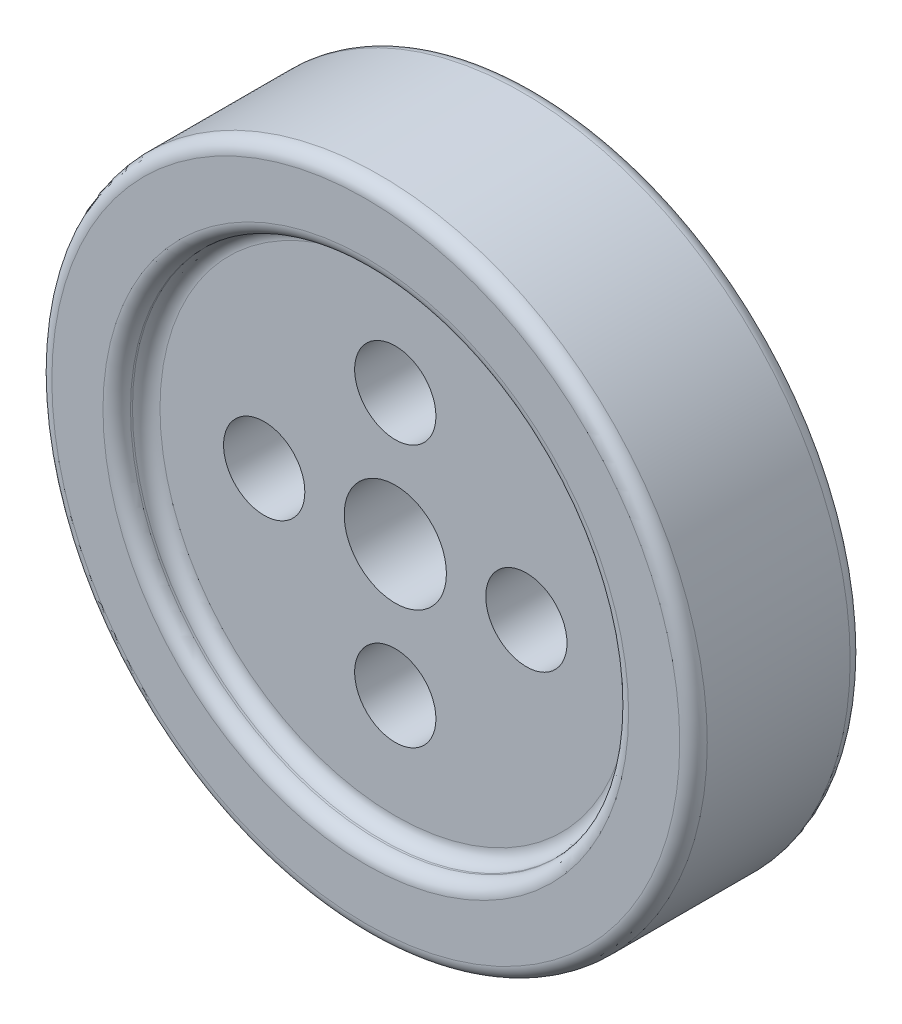
ISO-10303-21;
HEADER;
FILE_DESCRIPTION(('STEP AP214'),'2;1');
FILE_NAME('part.step','',(''),(''),'','','');
FILE_SCHEMA(('AUTOMOTIVE_DESIGN { 1 0 10303 214 1 1 1 1 }'));
ENDSEC;
DATA;
#1=APPLICATION_CONTEXT('core data for automotive mechanical design processes');
#2=APPLICATION_PROTOCOL_DEFINITION('international standard','automotive_design',2000,#1);
#3=PRODUCT_CONTEXT('',#1,'mechanical');
#4=PRODUCT('Part','Part','',(#3));
#5=PRODUCT_RELATED_PRODUCT_CATEGORY('part','',(#4));
#6=PRODUCT_DEFINITION_FORMATION('','',#4);
#7=PRODUCT_DEFINITION_CONTEXT('part definition',#1,'design');
#8=PRODUCT_DEFINITION('design','',#6,#7);
#9=PRODUCT_DEFINITION_SHAPE('','',#8);
#10=(LENGTH_UNIT() NAMED_UNIT(*) SI_UNIT(.MILLI.,.METRE.));
#11=(NAMED_UNIT(*) PLANE_ANGLE_UNIT() SI_UNIT($,.RADIAN.));
#12=(NAMED_UNIT(*) SI_UNIT($,.STERADIAN.) SOLID_ANGLE_UNIT());
#13=UNCERTAINTY_MEASURE_WITH_UNIT(LENGTH_MEASURE(1.E-05),#10,'distance_accuracy_value','');
#14=(GEOMETRIC_REPRESENTATION_CONTEXT(3) GLOBAL_UNCERTAINTY_ASSIGNED_CONTEXT((#13)) GLOBAL_UNIT_ASSIGNED_CONTEXT((#10,
#11,#12)) REPRESENTATION_CONTEXT('',''));
#15=CARTESIAN_POINT('',(0.,0.,0.));
#16=DIRECTION('',(0.,0.,1.));
#17=DIRECTION('',(1.,0.,0.));
#18=AXIS2_PLACEMENT_3D('',#15,#16,#17);
#19=CARTESIAN_POINT('',(0.,0.,130.));
#20=DIRECTION('',(0.,0.,-1.));
#21=DIRECTION('',(-1.,0.,0.));
#22=AXIS2_PLACEMENT_3D('',#19,#20,#21);
#23=CYLINDRICAL_SURFACE('',#22,250.);
#24=CARTESIAN_POINT('',(0.,0.,10.5));
#25=DIRECTION('',(0.,0.,1.));
#26=DIRECTION('',(1.,0.,0.));
#27=AXIS2_PLACEMENT_3D('',#24,#25,#26);
#28=CIRCLE('',#27,250.);
#29=CARTESIAN_POINT('',(250.,0.,10.5));
#30=VERTEX_POINT('',#29);
#31=EDGE_CURVE('E52',#30,#30,#28,.T.);
#32=ORIENTED_EDGE('',*,*,#31,.T.);
#33=EDGE_LOOP('',(#32));
#34=FACE_BOUND('',#33,.T.);
#35=CARTESIAN_POINT('',(0.,0.,119.5));
#36=DIRECTION('',(0.,0.,1.));
#37=DIRECTION('',(1.,0.,0.));
#38=AXIS2_PLACEMENT_3D('',#35,#36,#37);
#39=CIRCLE('',#38,250.);
#40=CARTESIAN_POINT('',(250.,0.,119.5));
#41=VERTEX_POINT('',#40);
#42=EDGE_CURVE('E99',#41,#41,#39,.F.);
#43=ORIENTED_EDGE('',*,*,#42,.T.);
#44=EDGE_LOOP('',(#43));
#45=FACE_BOUND('',#44,.T.);
#46=ADVANCED_FACE('F37',(#34,#45),#23,.T.);
#47=CARTESIAN_POINT('',(0.,0.,130.));
#48=DIRECTION('',(0.,0.,1.));
#49=DIRECTION('',(1.,0.,0.));
#50=AXIS2_PLACEMENT_3D('',#47,#48,#49);
#51=PLANE('',#50);
#52=CARTESIAN_POINT('',(0.,0.,130.));
#53=DIRECTION('',(0.,0.,1.));
#54=DIRECTION('',(1.,0.,0.));
#55=AXIS2_PLACEMENT_3D('',#52,#53,#54);
#56=CIRCLE('',#55,239.5);
#57=CARTESIAN_POINT('',(239.5,0.,130.));
#58=VERTEX_POINT('',#57);
#59=EDGE_CURVE('E95',#58,#58,#56,.T.);
#60=ORIENTED_EDGE('',*,*,#59,.T.);
#61=EDGE_LOOP('',(#60));
#62=FACE_BOUND('',#61,.T.);
#63=CARTESIAN_POINT('',(0.,0.,130.));
#64=DIRECTION('',(0.,0.,1.));
#65=DIRECTION('',(1.,0.,0.));
#66=AXIS2_PLACEMENT_3D('',#63,#64,#65);
#67=CIRCLE('',#66,200.5);
#68=CARTESIAN_POINT('',(200.5,0.,130.));
#69=VERTEX_POINT('',#68);
#70=EDGE_CURVE('E91',#69,#69,#67,.F.);
#71=ORIENTED_EDGE('',*,*,#70,.T.);
#72=EDGE_LOOP('',(#71));
#73=FACE_BOUND('',#72,.T.);
#74=ADVANCED_FACE('F134',(#62,#73),#51,.T.);
#75=CARTESIAN_POINT('',(0.,0.,0.));
#76=DIRECTION('',(0.,0.,1.));
#77=DIRECTION('',(1.,0.,0.));
#78=AXIS2_PLACEMENT_3D('',#75,#76,#77);
#79=PLANE('',#78);
#80=CARTESIAN_POINT('',(0.,0.,0.));
#81=DIRECTION('',(0.,0.,1.));
#82=DIRECTION('',(1.,0.,0.));
#83=AXIS2_PLACEMENT_3D('',#80,#81,#82);
#84=CIRCLE('',#83,239.5);
#85=CARTESIAN_POINT('',(239.5,0.,0.));
#86=VERTEX_POINT('',#85);
#87=EDGE_CURVE('E10',#86,#86,#84,.F.);
#88=ORIENTED_EDGE('',*,*,#87,.T.);
#89=EDGE_LOOP('',(#88));
#90=FACE_BOUND('',#89,.T.);
#91=CARTESIAN_POINT('',(0.,0.,0.));
#92=DIRECTION('',(0.,0.,1.));
#93=DIRECTION('',(1.,0.,0.));
#94=AXIS2_PLACEMENT_3D('',#91,#92,#93);
#95=CIRCLE('',#94,200.5);
#96=CARTESIAN_POINT('',(200.5,0.,0.));
#97=VERTEX_POINT('',#96);
#98=EDGE_CURVE('E46',#97,#97,#95,.T.);
#99=ORIENTED_EDGE('',*,*,#98,.T.);
#100=EDGE_LOOP('',(#99));
#101=FACE_BOUND('',#100,.T.);
#102=ADVANCED_FACE('F139',(#90,#101),#79,.F.);
#103=CARTESIAN_POINT('',(0.,0.,107.5));
#104=DIRECTION('',(0.,0.,1.));
#105=DIRECTION('',(1.,0.,0.));
#106=AXIS2_PLACEMENT_3D('',#103,#104,#105);
#107=CYLINDRICAL_SURFACE('',#106,190.);
#108=CARTESIAN_POINT('',(0.,0.,118.));
#109=DIRECTION('',(0.,0.,1.));
#110=DIRECTION('',(1.,0.,0.));
#111=AXIS2_PLACEMENT_3D('',#108,#109,#110);
#112=CIRCLE('',#111,190.);
#113=CARTESIAN_POINT('',(190.,0.,118.));
#114=VERTEX_POINT('',#113);
#115=EDGE_CURVE('E82',#114,#114,#112,.F.);
#116=ORIENTED_EDGE('',*,*,#115,.T.);
#117=EDGE_LOOP('',(#116));
#118=FACE_BOUND('',#117,.T.);
#119=CARTESIAN_POINT('',(0.,0.,119.5));
#120=DIRECTION('',(0.,0.,1.));
#121=DIRECTION('',(1.,0.,0.));
#122=AXIS2_PLACEMENT_3D('',#119,#120,#121);
#123=CIRCLE('',#122,190.);
#124=CARTESIAN_POINT('',(190.,0.,119.5));
#125=VERTEX_POINT('',#124);
#126=EDGE_CURVE('E76',#125,#125,#123,.T.);
#127=ORIENTED_EDGE('',*,*,#126,.T.);
#128=EDGE_LOOP('',(#127));
#129=FACE_BOUND('',#128,.T.);
#130=ADVANCED_FACE('F170',(#118,#129),#107,.F.);
#131=CARTESIAN_POINT('',(0.,0.,107.5));
#132=DIRECTION('',(0.,0.,1.));
#133=DIRECTION('',(1.,0.,0.));
#134=AXIS2_PLACEMENT_3D('',#131,#132,#133);
#135=PLANE('',#134);
#136=CARTESIAN_POINT('',(0.,0.,107.5));
#137=DIRECTION('',(0.,0.,1.));
#138=DIRECTION('',(1.,0.,0.));
#139=AXIS2_PLACEMENT_3D('',#136,#137,#138);
#140=CIRCLE('',#139,39.);
#141=CARTESIAN_POINT('',(39.,0.,107.5));
#142=VERTEX_POINT('',#141);
#143=EDGE_CURVE('E208',#142,#142,#140,.T.);
#144=ORIENTED_EDGE('',*,*,#143,.F.);
#145=EDGE_LOOP('',(#144));
#146=FACE_BOUND('',#145,.T.);
#147=CARTESIAN_POINT('',(-100.,0.,107.5));
#148=DIRECTION('',(0.,0.,1.));
#149=DIRECTION('',(1.,0.,0.));
#150=AXIS2_PLACEMENT_3D('',#147,#148,#149);
#151=CIRCLE('',#150,31.000000000001);
#152=CARTESIAN_POINT('',(-68.999999999999,0.,107.5));
#153=VERTEX_POINT('',#152);
#154=EDGE_CURVE('E61',#153,#153,#151,.T.);
#155=ORIENTED_EDGE('',*,*,#154,.F.);
#156=EDGE_LOOP('',(#155));
#157=FACE_BOUND('',#156,.T.);
#158=CARTESIAN_POINT('',(0.,100.,107.5));
#159=DIRECTION('',(0.,0.,1.));
#160=DIRECTION('',(1.,0.,0.));
#161=AXIS2_PLACEMENT_3D('',#158,#159,#160);
#162=CIRCLE('',#161,31.);
#163=CARTESIAN_POINT('',(31.,100.,107.5));
#164=VERTEX_POINT('',#163);
#165=EDGE_CURVE('E216',#164,#164,#162,.T.);
#166=ORIENTED_EDGE('',*,*,#165,.F.);
#167=EDGE_LOOP('',(#166));
#168=FACE_BOUND('',#167,.T.);
#169=CARTESIAN_POINT('',(100.000000000003,2.82380124105319E-12,107.5));
#170=DIRECTION('',(0.,0.,1.));
#171=DIRECTION('',(1.,0.,0.));
#172=AXIS2_PLACEMENT_3D('',#169,#170,#171);
#173=CIRCLE('',#172,31.0000000000022);
#174=CARTESIAN_POINT('',(131.000000000005,2.82380124105319E-12,107.5));
#175=VERTEX_POINT('',#174);
#176=EDGE_CURVE('E219',#175,#175,#173,.T.);
#177=ORIENTED_EDGE('',*,*,#176,.F.);
#178=EDGE_LOOP('',(#177));
#179=FACE_BOUND('',#178,.T.);
#180=CARTESIAN_POINT('',(0.,-100.,107.5));
#181=DIRECTION('',(0.,0.,1.));
#182=DIRECTION('',(1.,0.,0.));
#183=AXIS2_PLACEMENT_3D('',#180,#181,#182);
#184=CIRCLE('',#183,31.0000000000007);
#185=CARTESIAN_POINT('',(31.0000000000007,-100.,107.5));
#186=VERTEX_POINT('',#185);
#187=EDGE_CURVE('E85',#186,#186,#184,.T.);
#188=ORIENTED_EDGE('',*,*,#187,.F.);
#189=EDGE_LOOP('',(#188));
#190=FACE_BOUND('',#189,.T.);
#191=CARTESIAN_POINT('',(0.,0.,107.5));
#192=DIRECTION('',(0.,0.,1.));
#193=DIRECTION('',(1.,0.,0.));
#194=AXIS2_PLACEMENT_3D('',#191,#192,#193);
#195=CIRCLE('',#194,179.5);
#196=CARTESIAN_POINT('',(179.5,0.,107.5));
#197=VERTEX_POINT('',#196);
#198=EDGE_CURVE('E71',#197,#197,#195,.T.);
#199=ORIENTED_EDGE('',*,*,#198,.T.);
#200=EDGE_LOOP('',(#199));
#201=FACE_BOUND('',#200,.T.);
#202=ADVANCED_FACE('F148',(#146,#157,#168,#179,#190,#201),#135,.T.);
#203=CARTESIAN_POINT('',(0.,0.,118.));
#204=DIRECTION('',(0.,0.,1.));
#205=DIRECTION('',(1.,0.,0.));
#206=AXIS2_PLACEMENT_3D('',#203,#204,#205);
#207=TOROIDAL_SURFACE('',#206,179.5,10.5);
#208=ORIENTED_EDGE('',*,*,#115,.F.);
#209=EDGE_LOOP('',(#208));
#210=FACE_BOUND('',#209,.T.);
#211=ORIENTED_EDGE('',*,*,#198,.F.);
#212=EDGE_LOOP('',(#211));
#213=FACE_BOUND('',#212,.T.);
#214=ADVANCED_FACE('F144',(#210,#213),#207,.F.);
#215=CARTESIAN_POINT('',(0.,0.,119.5));
#216=DIRECTION('',(0.,0.,1.));
#217=DIRECTION('',(1.,0.,0.));
#218=AXIS2_PLACEMENT_3D('',#215,#216,#217);
#219=TOROIDAL_SURFACE('',#218,200.5,10.5);
#220=ORIENTED_EDGE('',*,*,#70,.F.);
#221=EDGE_LOOP('',(#220));
#222=FACE_BOUND('',#221,.T.);
#223=ORIENTED_EDGE('',*,*,#126,.F.);
#224=EDGE_LOOP('',(#223));
#225=FACE_BOUND('',#224,.T.);
#226=ADVANCED_FACE('F147',(#222,#225),#219,.T.);
#227=CARTESIAN_POINT('',(0.,0.,119.5));
#228=DIRECTION('',(0.,0.,1.));
#229=DIRECTION('',(1.,0.,0.));
#230=AXIS2_PLACEMENT_3D('',#227,#228,#229);
#231=TOROIDAL_SURFACE('',#230,239.5,10.5);
#232=ORIENTED_EDGE('',*,*,#42,.F.);
#233=EDGE_LOOP('',(#232));
#234=FACE_BOUND('',#233,.T.);
#235=ORIENTED_EDGE('',*,*,#59,.F.);
#236=EDGE_LOOP('',(#235));
#237=FACE_BOUND('',#236,.T.);
#238=ADVANCED_FACE('F152',(#234,#237),#231,.T.);
#239=CARTESIAN_POINT('',(0.,0.,22.5));
#240=DIRECTION('',(0.,0.,-1.));
#241=DIRECTION('',(-1.,0.,0.));
#242=AXIS2_PLACEMENT_3D('',#239,#240,#241);
#243=CYLINDRICAL_SURFACE('',#242,190.);
#244=CARTESIAN_POINT('',(0.,0.,12.));
#245=DIRECTION('',(0.,0.,-1.));
#246=DIRECTION('',(-1.,0.,0.));
#247=AXIS2_PLACEMENT_3D('',#244,#245,#246);
#248=CIRCLE('',#247,190.);
#249=CARTESIAN_POINT('',(-190.,0.,12.));
#250=VERTEX_POINT('',#249);
#251=EDGE_CURVE('E111',#250,#250,#248,.F.);
#252=ORIENTED_EDGE('',*,*,#251,.T.);
#253=EDGE_LOOP('',(#252));
#254=FACE_BOUND('',#253,.T.);
#255=CARTESIAN_POINT('',(0.,0.,10.5));
#256=DIRECTION('',(0.,0.,1.));
#257=DIRECTION('',(1.,0.,0.));
#258=AXIS2_PLACEMENT_3D('',#255,#256,#257);
#259=CIRCLE('',#258,190.);
#260=CARTESIAN_POINT('',(190.,0.,10.5));
#261=VERTEX_POINT('',#260);
#262=EDGE_CURVE('E107',#261,#261,#259,.F.);
#263=ORIENTED_EDGE('',*,*,#262,.T.);
#264=EDGE_LOOP('',(#263));
#265=FACE_BOUND('',#264,.T.);
#266=ADVANCED_FACE('F155',(#254,#265),#243,.F.);
#267=CARTESIAN_POINT('',(0.,0.,22.5));
#268=DIRECTION('',(0.,0.,-1.));
#269=DIRECTION('',(-1.,0.,0.));
#270=AXIS2_PLACEMENT_3D('',#267,#268,#269);
#271=PLANE('',#270);
#272=CARTESIAN_POINT('',(0.,0.,22.5));
#273=DIRECTION('',(0.,0.,-1.));
#274=DIRECTION('',(-1.,0.,0.));
#275=AXIS2_PLACEMENT_3D('',#272,#273,#274);
#276=CIRCLE('',#275,39.);
#277=CARTESIAN_POINT('',(-39.,0.,22.5));
#278=VERTEX_POINT('',#277);
#279=EDGE_CURVE('E41',#278,#278,#276,.T.);
#280=ORIENTED_EDGE('',*,*,#279,.F.);
#281=EDGE_LOOP('',(#280));
#282=FACE_BOUND('',#281,.T.);
#283=CARTESIAN_POINT('',(-100.,0.,22.5));
#284=DIRECTION('',(0.,0.,-1.));
#285=DIRECTION('',(-1.,0.,0.));
#286=AXIS2_PLACEMENT_3D('',#283,#284,#285);
#287=CIRCLE('',#286,31.000000000001);
#288=CARTESIAN_POINT('',(-131.000000000001,0.,22.5));
#289=VERTEX_POINT('',#288);
#290=EDGE_CURVE('E68',#289,#289,#287,.T.);
#291=ORIENTED_EDGE('',*,*,#290,.F.);
#292=EDGE_LOOP('',(#291));
#293=FACE_BOUND('',#292,.T.);
#294=CARTESIAN_POINT('',(0.,100.,22.5));
#295=DIRECTION('',(0.,0.,-1.));
#296=DIRECTION('',(-1.,0.,0.));
#297=AXIS2_PLACEMENT_3D('',#294,#295,#296);
#298=CIRCLE('',#297,31.);
#299=CARTESIAN_POINT('',(-31.,100.,22.5));
#300=VERTEX_POINT('',#299);
#301=EDGE_CURVE('E65',#300,#300,#298,.T.);
#302=ORIENTED_EDGE('',*,*,#301,.F.);
#303=EDGE_LOOP('',(#302));
#304=FACE_BOUND('',#303,.T.);
#305=CARTESIAN_POINT('',(100.000000000003,2.82380124105319E-12,22.5));
#306=DIRECTION('',(0.,0.,-1.));
#307=DIRECTION('',(-1.,0.,0.));
#308=AXIS2_PLACEMENT_3D('',#305,#306,#307);
#309=CIRCLE('',#308,31.0000000000022);
#310=CARTESIAN_POINT('',(69.0000000000006,2.82380124105319E-12,22.5));
#311=VERTEX_POINT('',#310);
#312=EDGE_CURVE('E60',#311,#311,#309,.T.);
#313=ORIENTED_EDGE('',*,*,#312,.F.);
#314=EDGE_LOOP('',(#313));
#315=FACE_BOUND('',#314,.T.);
#316=CARTESIAN_POINT('',(0.,-100.,22.5));
#317=DIRECTION('',(0.,0.,-1.));
#318=DIRECTION('',(-1.,0.,0.));
#319=AXIS2_PLACEMENT_3D('',#316,#317,#318);
#320=CIRCLE('',#319,31.0000000000007);
#321=CARTESIAN_POINT('',(-31.0000000000007,-100.,22.5));
#322=VERTEX_POINT('',#321);
#323=EDGE_CURVE('E56',#322,#322,#320,.T.);
#324=ORIENTED_EDGE('',*,*,#323,.F.);
#325=EDGE_LOOP('',(#324));
#326=FACE_BOUND('',#325,.T.);
#327=CARTESIAN_POINT('',(0.,0.,22.5));
#328=DIRECTION('',(0.,0.,-1.));
#329=DIRECTION('',(-1.,0.,0.));
#330=AXIS2_PLACEMENT_3D('',#327,#328,#329);
#331=CIRCLE('',#330,179.5);
#332=CARTESIAN_POINT('',(-179.5,0.,22.5));
#333=VERTEX_POINT('',#332);
#334=EDGE_CURVE('E103',#333,#333,#331,.T.);
#335=ORIENTED_EDGE('',*,*,#334,.T.);
#336=EDGE_LOOP('',(#335));
#337=FACE_BOUND('',#336,.T.);
#338=ADVANCED_FACE('F130',(#282,#293,#304,#315,#326,#337),#271,.T.);
#339=CARTESIAN_POINT('',(0.,0.,12.));
#340=DIRECTION('',(0.,0.,-1.));
#341=DIRECTION('',(-1.,0.,0.));
#342=AXIS2_PLACEMENT_3D('',#339,#340,#341);
#343=TOROIDAL_SURFACE('',#342,179.5,10.5);
#344=ORIENTED_EDGE('',*,*,#251,.F.);
#345=EDGE_LOOP('',(#344));
#346=FACE_BOUND('',#345,.T.);
#347=ORIENTED_EDGE('',*,*,#334,.F.);
#348=EDGE_LOOP('',(#347));
#349=FACE_BOUND('',#348,.T.);
#350=ADVANCED_FACE('F122',(#346,#349),#343,.F.);
#351=CARTESIAN_POINT('',(0.,0.,10.5));
#352=DIRECTION('',(0.,0.,1.));
#353=DIRECTION('',(1.,0.,0.));
#354=AXIS2_PLACEMENT_3D('',#351,#352,#353);
#355=TOROIDAL_SURFACE('',#354,239.5,10.5);
#356=ORIENTED_EDGE('',*,*,#87,.F.);
#357=EDGE_LOOP('',(#356));
#358=FACE_BOUND('',#357,.T.);
#359=ORIENTED_EDGE('',*,*,#31,.F.);
#360=EDGE_LOOP('',(#359));
#361=FACE_BOUND('',#360,.T.);
#362=ADVANCED_FACE('F120',(#358,#361),#355,.T.);
#363=CARTESIAN_POINT('',(0.,0.,10.5));
#364=DIRECTION('',(0.,0.,1.));
#365=DIRECTION('',(1.,0.,0.));
#366=AXIS2_PLACEMENT_3D('',#363,#364,#365);
#367=TOROIDAL_SURFACE('',#366,200.5,10.5);
#368=ORIENTED_EDGE('',*,*,#262,.F.);
#369=EDGE_LOOP('',(#368));
#370=FACE_BOUND('',#369,.T.);
#371=ORIENTED_EDGE('',*,*,#98,.F.);
#372=EDGE_LOOP('',(#371));
#373=FACE_BOUND('',#372,.T.);
#374=ADVANCED_FACE('F39',(#370,#373),#367,.T.);
#375=CARTESIAN_POINT('',(0.,-100.,0.));
#376=DIRECTION('',(0.,0.,1.));
#377=DIRECTION('',(1.,0.,0.));
#378=AXIS2_PLACEMENT_3D('',#375,#376,#377);
#379=CYLINDRICAL_SURFACE('',#378,31.0000000000007);
#380=ORIENTED_EDGE('',*,*,#323,.T.);
#381=EDGE_LOOP('',(#380));
#382=FACE_BOUND('',#381,.T.);
#383=ORIENTED_EDGE('',*,*,#187,.T.);
#384=EDGE_LOOP('',(#383));
#385=FACE_BOUND('',#384,.T.);
#386=ADVANCED_FACE('F128',(#382,#385),#379,.F.);
#387=CARTESIAN_POINT('',(100.000000000003,2.82380124105319E-12,0.));
#388=DIRECTION('',(0.,0.,1.));
#389=DIRECTION('',(1.,0.,0.));
#390=AXIS2_PLACEMENT_3D('',#387,#388,#389);
#391=CYLINDRICAL_SURFACE('',#390,31.0000000000022);
#392=ORIENTED_EDGE('',*,*,#312,.T.);
#393=EDGE_LOOP('',(#392));
#394=FACE_BOUND('',#393,.T.);
#395=ORIENTED_EDGE('',*,*,#176,.T.);
#396=EDGE_LOOP('',(#395));
#397=FACE_BOUND('',#396,.T.);
#398=ADVANCED_FACE('F186',(#394,#397),#391,.F.);
#399=CARTESIAN_POINT('',(0.,100.,0.));
#400=DIRECTION('',(0.,0.,1.));
#401=DIRECTION('',(1.,0.,0.));
#402=AXIS2_PLACEMENT_3D('',#399,#400,#401);
#403=CYLINDRICAL_SURFACE('',#402,31.);
#404=ORIENTED_EDGE('',*,*,#301,.T.);
#405=EDGE_LOOP('',(#404));
#406=FACE_BOUND('',#405,.T.);
#407=ORIENTED_EDGE('',*,*,#165,.T.);
#408=EDGE_LOOP('',(#407));
#409=FACE_BOUND('',#408,.T.);
#410=ADVANCED_FACE('F190',(#406,#409),#403,.F.);
#411=CARTESIAN_POINT('',(-100.,0.,0.));
#412=DIRECTION('',(0.,0.,1.));
#413=DIRECTION('',(1.,0.,0.));
#414=AXIS2_PLACEMENT_3D('',#411,#412,#413);
#415=CYLINDRICAL_SURFACE('',#414,31.000000000001);
#416=ORIENTED_EDGE('',*,*,#290,.T.);
#417=EDGE_LOOP('',(#416));
#418=FACE_BOUND('',#417,.T.);
#419=ORIENTED_EDGE('',*,*,#154,.T.);
#420=EDGE_LOOP('',(#419));
#421=FACE_BOUND('',#420,.T.);
#422=ADVANCED_FACE('F194',(#418,#421),#415,.F.);
#423=CARTESIAN_POINT('',(0.,0.,0.));
#424=DIRECTION('',(0.,0.,1.));
#425=DIRECTION('',(1.,0.,0.));
#426=AXIS2_PLACEMENT_3D('',#423,#424,#425);
#427=CYLINDRICAL_SURFACE('',#426,39.);
#428=ORIENTED_EDGE('',*,*,#279,.T.);
#429=EDGE_LOOP('',(#428));
#430=FACE_BOUND('',#429,.T.);
#431=ORIENTED_EDGE('',*,*,#143,.T.);
#432=EDGE_LOOP('',(#431));
#433=FACE_BOUND('',#432,.T.);
#434=ADVANCED_FACE('F198',(#430,#433),#427,.F.);
#435=CLOSED_SHELL('',(#46,#74,#102,#130,#202,#214,#226,#238,#266,#338,#350,#362,#374,#386,#398,
#410,#422,#434));
#436=MANIFOLD_SOLID_BREP('B2',#435);
#437=ADVANCED_BREP_SHAPE_REPRESENTATION('',(#18,#436),#14);
#438=SHAPE_DEFINITION_REPRESENTATION(#9,#437);
ENDSEC;
END-ISO-10303-21;
